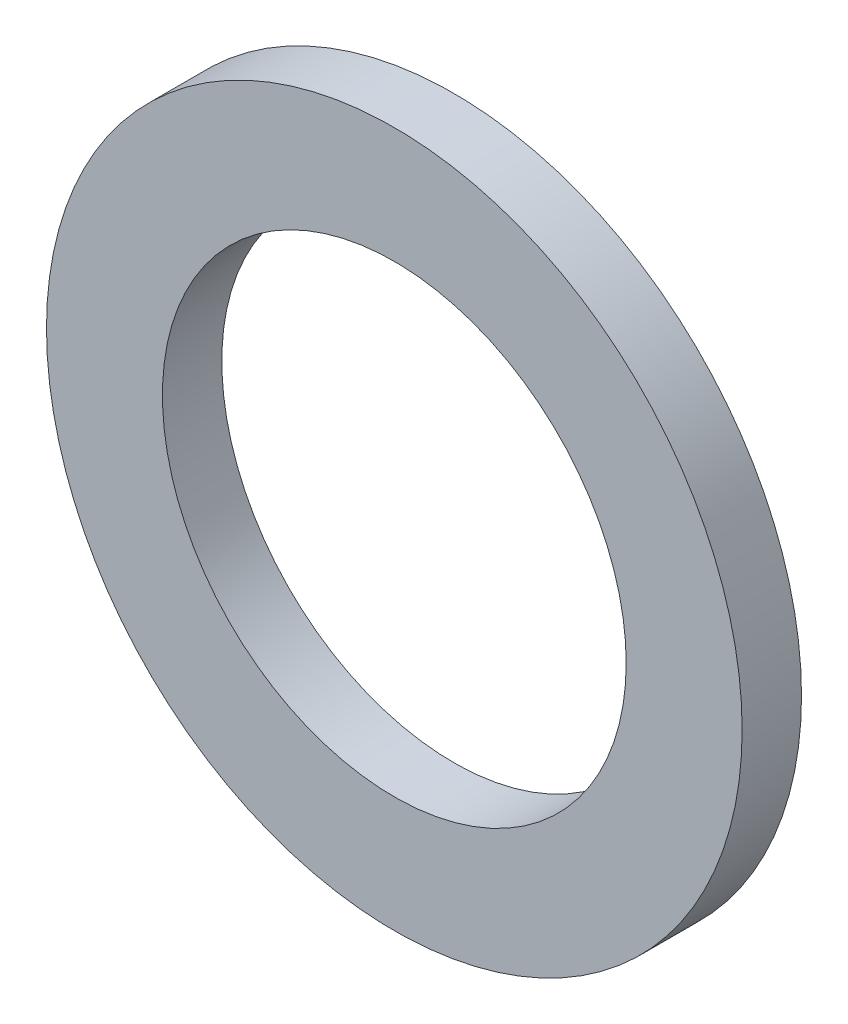
ISO-10303-21;
HEADER;
FILE_DESCRIPTION(('STEP AP214'),'2;1');
FILE_NAME('part.step','',(''),(''),'','','');
FILE_SCHEMA(('AUTOMOTIVE_DESIGN { 1 0 10303 214 1 1 1 1 }'));
ENDSEC;
DATA;
#1=APPLICATION_CONTEXT('core data for automotive mechanical design processes');
#2=APPLICATION_PROTOCOL_DEFINITION('international standard','automotive_design',2000,#1);
#3=PRODUCT_CONTEXT('',#1,'mechanical');
#4=PRODUCT('Part','Part','',(#3));
#5=PRODUCT_RELATED_PRODUCT_CATEGORY('part','',(#4));
#6=PRODUCT_DEFINITION_FORMATION('','',#4);
#7=PRODUCT_DEFINITION_CONTEXT('part definition',#1,'design');
#8=PRODUCT_DEFINITION('design','',#6,#7);
#9=PRODUCT_DEFINITION_SHAPE('','',#8);
#10=(LENGTH_UNIT() NAMED_UNIT(*) SI_UNIT(.MILLI.,.METRE.));
#11=(NAMED_UNIT(*) PLANE_ANGLE_UNIT() SI_UNIT($,.RADIAN.));
#12=(NAMED_UNIT(*) SI_UNIT($,.STERADIAN.) SOLID_ANGLE_UNIT());
#13=UNCERTAINTY_MEASURE_WITH_UNIT(LENGTH_MEASURE(1.E-05),#10,'distance_accuracy_value','');
#14=(GEOMETRIC_REPRESENTATION_CONTEXT(3) GLOBAL_UNCERTAINTY_ASSIGNED_CONTEXT((#13)) GLOBAL_UNIT_ASSIGNED_CONTEXT((#10,
#11,#12)) REPRESENTATION_CONTEXT('',''));
#15=CARTESIAN_POINT('',(0.,0.,0.));
#16=DIRECTION('',(0.,0.,1.));
#17=DIRECTION('',(1.,0.,0.));
#18=AXIS2_PLACEMENT_3D('',#15,#16,#17);
#19=CARTESIAN_POINT('',(0.,0.,0.4064));
#20=DIRECTION('',(0.,0.,1.));
#21=DIRECTION('',(1.,0.,0.));
#22=AXIS2_PLACEMENT_3D('',#19,#20,#21);
#23=PLANE('',#22);
#24=CARTESIAN_POINT('',(0.,0.,0.4064));
#25=DIRECTION('',(0.,0.,1.));
#26=DIRECTION('',(1.,0.,0.));
#27=AXIS2_PLACEMENT_3D('',#24,#25,#26);
#28=CIRCLE('',#27,2.38125);
#29=CARTESIAN_POINT('',(2.38125,0.,0.4064));
#30=VERTEX_POINT('',#29);
#31=EDGE_CURVE('E10',#30,#30,#28,.T.);
#32=ORIENTED_EDGE('',*,*,#31,.T.);
#33=EDGE_LOOP('',(#32));
#34=FACE_BOUND('',#33,.T.);
#35=CARTESIAN_POINT('',(0.,0.,0.4064));
#36=DIRECTION('',(0.,0.,1.));
#37=DIRECTION('',(1.,0.,0.));
#38=AXIS2_PLACEMENT_3D('',#35,#36,#37);
#39=CIRCLE('',#38,1.5875);
#40=CARTESIAN_POINT('',(1.5875,0.,0.4064));
#41=VERTEX_POINT('',#40);
#42=EDGE_CURVE('E42',#41,#41,#39,.T.);
#43=ORIENTED_EDGE('',*,*,#42,.F.);
#44=EDGE_LOOP('',(#43));
#45=FACE_BOUND('',#44,.T.);
#46=ADVANCED_FACE('F31',(#34,#45),#23,.T.);
#47=CARTESIAN_POINT('',(0.,0.,0.));
#48=DIRECTION('',(0.,0.,1.));
#49=DIRECTION('',(1.,0.,0.));
#50=AXIS2_PLACEMENT_3D('',#47,#48,#49);
#51=PLANE('',#50);
#52=CARTESIAN_POINT('',(0.,0.,0.));
#53=DIRECTION('',(0.,0.,1.));
#54=DIRECTION('',(1.,0.,0.));
#55=AXIS2_PLACEMENT_3D('',#52,#53,#54);
#56=CIRCLE('',#55,2.38125);
#57=CARTESIAN_POINT('',(2.38125,0.,0.));
#58=VERTEX_POINT('',#57);
#59=EDGE_CURVE('E35',#58,#58,#56,.T.);
#60=ORIENTED_EDGE('',*,*,#59,.F.);
#61=EDGE_LOOP('',(#60));
#62=FACE_BOUND('',#61,.T.);
#63=CARTESIAN_POINT('',(0.,0.,0.));
#64=DIRECTION('',(0.,0.,1.));
#65=DIRECTION('',(1.,0.,0.));
#66=AXIS2_PLACEMENT_3D('',#63,#64,#65);
#67=CIRCLE('',#66,1.5875);
#68=CARTESIAN_POINT('',(1.5875,0.,0.));
#69=VERTEX_POINT('',#68);
#70=EDGE_CURVE('E44',#69,#69,#67,.T.);
#71=ORIENTED_EDGE('',*,*,#70,.T.);
#72=EDGE_LOOP('',(#71));
#73=FACE_BOUND('',#72,.T.);
#74=ADVANCED_FACE('F54',(#62,#73),#51,.F.);
#75=CARTESIAN_POINT('',(0.,0.,0.4064));
#76=DIRECTION('',(0.,0.,-1.));
#77=DIRECTION('',(-1.,0.,0.));
#78=AXIS2_PLACEMENT_3D('',#75,#76,#77);
#79=CYLINDRICAL_SURFACE('',#78,2.38125);
#80=ORIENTED_EDGE('',*,*,#31,.F.);
#81=EDGE_LOOP('',(#80));
#82=FACE_BOUND('',#81,.T.);
#83=ORIENTED_EDGE('',*,*,#59,.T.);
#84=EDGE_LOOP('',(#83));
#85=FACE_BOUND('',#84,.T.);
#86=ADVANCED_FACE('F33',(#82,#85),#79,.T.);
#87=CARTESIAN_POINT('',(0.,0.,0.4064));
#88=DIRECTION('',(0.,0.,-1.));
#89=DIRECTION('',(-1.,0.,0.));
#90=AXIS2_PLACEMENT_3D('',#87,#88,#89);
#91=CYLINDRICAL_SURFACE('',#90,1.5875);
#92=ORIENTED_EDGE('',*,*,#42,.T.);
#93=EDGE_LOOP('',(#92));
#94=FACE_BOUND('',#93,.T.);
#95=ORIENTED_EDGE('',*,*,#70,.F.);
#96=EDGE_LOOP('',(#95));
#97=FACE_BOUND('',#96,.T.);
#98=ADVANCED_FACE('F50',(#94,#97),#91,.F.);
#99=CLOSED_SHELL('',(#46,#74,#86,#98));
#100=MANIFOLD_SOLID_BREP('B2',#99);
#101=ADVANCED_BREP_SHAPE_REPRESENTATION('',(#18,#100),#14);
#102=SHAPE_DEFINITION_REPRESENTATION(#9,#101);
ENDSEC;
END-ISO-10303-21;
